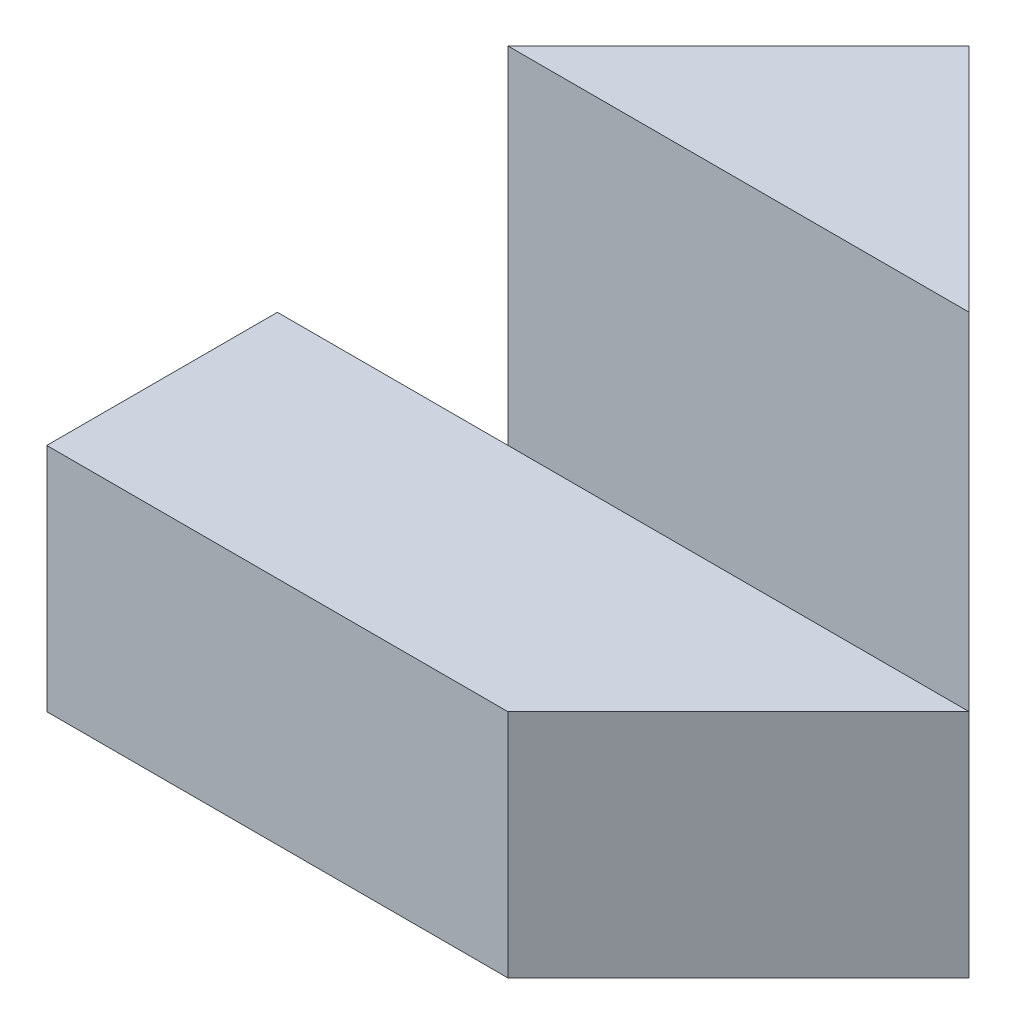
ISO-10303-21;
HEADER;
FILE_DESCRIPTION(('STEP AP214'),'2;1');
FILE_NAME('part.step','',(''),(''),'','','');
FILE_SCHEMA(('AUTOMOTIVE_DESIGN { 1 0 10303 214 1 1 1 1 }'));
ENDSEC;
DATA;
#1=APPLICATION_CONTEXT('core data for automotive mechanical design processes');
#2=APPLICATION_PROTOCOL_DEFINITION('international standard','automotive_design',2000,#1);
#3=PRODUCT_CONTEXT('',#1,'mechanical');
#4=PRODUCT('Part','Part','',(#3));
#5=PRODUCT_RELATED_PRODUCT_CATEGORY('part','',(#4));
#6=PRODUCT_DEFINITION_FORMATION('','',#4);
#7=PRODUCT_DEFINITION_CONTEXT('part definition',#1,'design');
#8=PRODUCT_DEFINITION('design','',#6,#7);
#9=PRODUCT_DEFINITION_SHAPE('','',#8);
#10=(LENGTH_UNIT() NAMED_UNIT(*) SI_UNIT(.MILLI.,.METRE.));
#11=(NAMED_UNIT(*) PLANE_ANGLE_UNIT() SI_UNIT($,.RADIAN.));
#12=(NAMED_UNIT(*) SI_UNIT($,.STERADIAN.) SOLID_ANGLE_UNIT());
#13=UNCERTAINTY_MEASURE_WITH_UNIT(LENGTH_MEASURE(1.E-05),#10,'distance_accuracy_value','');
#14=(GEOMETRIC_REPRESENTATION_CONTEXT(3) GLOBAL_UNCERTAINTY_ASSIGNED_CONTEXT((#13)) GLOBAL_UNIT_ASSIGNED_CONTEXT((#10,
#11,#12)) REPRESENTATION_CONTEXT('',''));
#15=CARTESIAN_POINT('',(0.,0.,0.));
#16=DIRECTION('',(0.,0.,1.));
#17=DIRECTION('',(1.,0.,0.));
#18=AXIS2_PLACEMENT_3D('',#15,#16,#17);
#19=CARTESIAN_POINT('',(0.,0.,2.));
#20=DIRECTION('',(0.,0.,-1.));
#21=DIRECTION('',(-1.,0.,0.));
#22=AXIS2_PLACEMENT_3D('',#19,#20,#21);
#23=PLANE('',#22);
#24=DIRECTION('',(-1.,0.,0.));
#25=VECTOR('',#24,1.);
#26=CARTESIAN_POINT('',(-2.,2.5,2.));
#27=LINE('',#26,#25);
#28=CARTESIAN_POINT('',(4.,2.5,2.));
#29=VERTEX_POINT('',#28);
#30=CARTESIAN_POINT('',(0.,2.5,2.));
#31=VERTEX_POINT('',#30);
#32=EDGE_CURVE('E43',#29,#31,#27,.T.);
#33=ORIENTED_EDGE('',*,*,#32,.T.);
#34=DIRECTION('',(0.,1.,0.));
#35=VECTOR('',#34,1.);
#36=CARTESIAN_POINT('',(0.,-2.5,2.));
#37=LINE('',#36,#35);
#38=CARTESIAN_POINT('',(0.,-0.5,2.));
#39=VERTEX_POINT('',#38);
#40=EDGE_CURVE('E112',#39,#31,#37,.T.);
#41=ORIENTED_EDGE('',*,*,#40,.F.);
#42=DIRECTION('',(-1.,0.,0.));
#43=VECTOR('',#42,1.);
#44=CARTESIAN_POINT('',(-2.,-0.5,2.));
#45=LINE('',#44,#43);
#46=CARTESIAN_POINT('',(4.,-0.5,2.));
#47=VERTEX_POINT('',#46);
#48=EDGE_CURVE('E123',#47,#39,#45,.T.);
#49=ORIENTED_EDGE('',*,*,#48,.F.);
#50=DIRECTION('',(0.,1.,0.));
#51=VECTOR('',#50,1.);
#52=CARTESIAN_POINT('',(4.,-2.5,2.));
#53=LINE('',#52,#51);
#54=EDGE_CURVE('E149',#47,#29,#53,.T.);
#55=ORIENTED_EDGE('',*,*,#54,.T.);
#56=EDGE_LOOP('',(#33,#41,#49,#55));
#57=FACE_BOUND('',#56,.T.);
#58=ADVANCED_FACE('F33',(#57),#23,.F.);
#59=CARTESIAN_POINT('',(-2.,2.5,2.));
#60=DIRECTION('',(0.,-1.,0.));
#61=DIRECTION('',(0.,0.,-1.));
#62=AXIS2_PLACEMENT_3D('',#59,#60,#61);
#63=PLANE('',#62);
#64=DIRECTION('',(-0.707106781186548,0.,-0.707106781186548));
#65=VECTOR('',#64,1.);
#66=CARTESIAN_POINT('',(2.,2.5,0.));
#67=LINE('',#66,#65);
#68=CARTESIAN_POINT('',(2.,2.5,0.));
#69=VERTEX_POINT('',#68);
#70=EDGE_CURVE('E152',#29,#69,#67,.T.);
#71=ORIENTED_EDGE('',*,*,#70,.T.);
#72=DIRECTION('',(0.707106781186547,0.,-0.707106781186548));
#73=VECTOR('',#72,1.);
#74=CARTESIAN_POINT('',(0.,2.5,2.));
#75=LINE('',#74,#73);
#76=EDGE_CURVE('E104',#31,#69,#75,.T.);
#77=ORIENTED_EDGE('',*,*,#76,.F.);
#78=ORIENTED_EDGE('',*,*,#32,.F.);
#79=EDGE_LOOP('',(#71,#77,#78));
#80=FACE_BOUND('',#79,.T.);
#81=ADVANCED_FACE('F35',(#80),#63,.F.);
#82=CARTESIAN_POINT('',(-2.,-2.5,2.));
#83=DIRECTION('',(1.,0.,0.));
#84=DIRECTION('',(0.,0.,-1.));
#85=AXIS2_PLACEMENT_3D('',#82,#83,#84);
#86=PLANE('',#85);
#87=DIRECTION('',(0.,0.,-1.));
#88=VECTOR('',#87,1.);
#89=CARTESIAN_POINT('',(-2.,-0.5,4.));
#90=LINE('',#89,#88);
#91=CARTESIAN_POINT('',(-2.,-0.5,4.));
#92=VERTEX_POINT('',#91);
#93=CARTESIAN_POINT('',(-2.,-0.5,2.));
#94=VERTEX_POINT('',#93);
#95=EDGE_CURVE('E111',#92,#94,#90,.T.);
#96=ORIENTED_EDGE('',*,*,#95,.T.);
#97=DIRECTION('',(0.,1.,0.));
#98=VECTOR('',#97,1.);
#99=CARTESIAN_POINT('',(-2.,-2.5,2.));
#100=LINE('',#99,#98);
#101=CARTESIAN_POINT('',(-2.,-2.5,2.));
#102=VERTEX_POINT('',#101);
#103=EDGE_CURVE('E96',#102,#94,#100,.T.);
#104=ORIENTED_EDGE('',*,*,#103,.F.);
#105=DIRECTION('',(0.,0.,-1.));
#106=VECTOR('',#105,1.);
#107=CARTESIAN_POINT('',(-2.,-2.5,2.));
#108=LINE('',#107,#106);
#109=CARTESIAN_POINT('',(-2.,-2.5,4.));
#110=VERTEX_POINT('',#109);
#111=EDGE_CURVE('E11',#110,#102,#108,.T.);
#112=ORIENTED_EDGE('',*,*,#111,.F.);
#113=DIRECTION('',(0.,-1.,0.));
#114=VECTOR('',#113,1.);
#115=CARTESIAN_POINT('',(-2.,-2.5,4.));
#116=LINE('',#115,#114);
#117=EDGE_CURVE('E120',#92,#110,#116,.T.);
#118=ORIENTED_EDGE('',*,*,#117,.F.);
#119=EDGE_LOOP('',(#96,#104,#112,#118));
#120=FACE_BOUND('',#119,.T.);
#121=ADVANCED_FACE('F108',(#120),#86,.F.);
#122=CARTESIAN_POINT('',(-2.,-2.5,2.));
#123=DIRECTION('',(0.,1.,0.));
#124=DIRECTION('',(0.,0.,1.));
#125=AXIS2_PLACEMENT_3D('',#122,#123,#124);
#126=PLANE('',#125);
#127=DIRECTION('',(1.,0.,0.));
#128=VECTOR('',#127,1.);
#129=CARTESIAN_POINT('',(-2.,-2.5,2.));
#130=LINE('',#129,#128);
#131=CARTESIAN_POINT('',(0.,-2.5,2.));
#132=VERTEX_POINT('',#131);
#133=EDGE_CURVE('E93',#102,#132,#130,.T.);
#134=ORIENTED_EDGE('',*,*,#133,.T.);
#135=DIRECTION('',(0.707106781186547,0.,-0.707106781186548));
#136=VECTOR('',#135,1.);
#137=CARTESIAN_POINT('',(0.,-2.5,2.));
#138=LINE('',#137,#136);
#139=CARTESIAN_POINT('',(2.,-2.5,0.));
#140=VERTEX_POINT('',#139);
#141=EDGE_CURVE('E103',#132,#140,#138,.T.);
#142=ORIENTED_EDGE('',*,*,#141,.T.);
#143=DIRECTION('',(-0.707106781186548,0.,-0.707106781186548));
#144=VECTOR('',#143,1.);
#145=CARTESIAN_POINT('',(2.,-2.5,0.));
#146=LINE('',#145,#144);
#147=CARTESIAN_POINT('',(4.,-2.5,2.));
#148=VERTEX_POINT('',#147);
#149=EDGE_CURVE('E160',#148,#140,#146,.T.);
#150=ORIENTED_EDGE('',*,*,#149,.F.);
#151=DIRECTION('',(0.707106781186547,0.,-0.707106781186548));
#152=VECTOR('',#151,1.);
#153=CARTESIAN_POINT('',(2.,-2.5,4.));
#154=LINE('',#153,#152);
#155=CARTESIAN_POINT('',(2.,-2.5,4.));
#156=VERTEX_POINT('',#155);
#157=EDGE_CURVE('E119',#156,#148,#154,.T.);
#158=ORIENTED_EDGE('',*,*,#157,.F.);
#159=DIRECTION('',(1.,0.,0.));
#160=VECTOR('',#159,1.);
#161=CARTESIAN_POINT('',(-2.,-2.5,4.));
#162=LINE('',#161,#160);
#163=EDGE_CURVE('E116',#110,#156,#162,.T.);
#164=ORIENTED_EDGE('',*,*,#163,.F.);
#165=ORIENTED_EDGE('',*,*,#111,.T.);
#166=EDGE_LOOP('',(#134,#142,#150,#158,#164,#165));
#167=FACE_BOUND('',#166,.T.);
#168=ADVANCED_FACE('F114',(#167),#126,.F.);
#169=CARTESIAN_POINT('',(-2.,-0.5,4.));
#170=DIRECTION('',(0.,-1.,0.));
#171=DIRECTION('',(0.,0.,-1.));
#172=AXIS2_PLACEMENT_3D('',#169,#170,#171);
#173=PLANE('',#172);
#174=ORIENTED_EDGE('',*,*,#48,.T.);
#175=EDGE_CURVE('E37',#39,#94,#45,.T.);
#176=ORIENTED_EDGE('',*,*,#175,.T.);
#177=ORIENTED_EDGE('',*,*,#95,.F.);
#178=DIRECTION('',(-1.,0.,0.));
#179=VECTOR('',#178,1.);
#180=CARTESIAN_POINT('',(-2.,-0.5,4.));
#181=LINE('',#180,#179);
#182=CARTESIAN_POINT('',(2.,-0.5,4.));
#183=VERTEX_POINT('',#182);
#184=EDGE_CURVE('E51',#183,#92,#181,.T.);
#185=ORIENTED_EDGE('',*,*,#184,.F.);
#186=DIRECTION('',(0.707106781186547,0.,-0.707106781186548));
#187=VECTOR('',#186,1.);
#188=CARTESIAN_POINT('',(2.,-0.5,4.));
#189=LINE('',#188,#187);
#190=EDGE_CURVE('E164',#183,#47,#189,.T.);
#191=ORIENTED_EDGE('',*,*,#190,.T.);
#192=EDGE_LOOP('',(#174,#176,#177,#185,#191));
#193=FACE_BOUND('',#192,.T.);
#194=ADVANCED_FACE('F168',(#193),#173,.F.);
#195=CARTESIAN_POINT('',(0.,0.,4.));
#196=DIRECTION('',(0.,0.,-1.));
#197=DIRECTION('',(-1.,0.,0.));
#198=AXIS2_PLACEMENT_3D('',#195,#196,#197);
#199=PLANE('',#198);
#200=ORIENTED_EDGE('',*,*,#117,.T.);
#201=ORIENTED_EDGE('',*,*,#163,.T.);
#202=DIRECTION('',(0.,1.,0.));
#203=VECTOR('',#202,1.);
#204=CARTESIAN_POINT('',(2.,-2.5,4.));
#205=LINE('',#204,#203);
#206=EDGE_CURVE('E56',#156,#183,#205,.T.);
#207=ORIENTED_EDGE('',*,*,#206,.T.);
#208=ORIENTED_EDGE('',*,*,#184,.T.);
#209=EDGE_LOOP('',(#200,#201,#207,#208));
#210=FACE_BOUND('',#209,.T.);
#211=ADVANCED_FACE('F122',(#210),#199,.F.);
#212=CARTESIAN_POINT('',(2.,-2.5,4.));
#213=DIRECTION('',(0.707106781186548,0.,0.707106781186547));
#214=DIRECTION('',(0.707106781186547,0.,-0.707106781186548));
#215=AXIS2_PLACEMENT_3D('',#212,#213,#214);
#216=PLANE('',#215);
#217=ORIENTED_EDGE('',*,*,#190,.F.);
#218=ORIENTED_EDGE('',*,*,#206,.F.);
#219=ORIENTED_EDGE('',*,*,#157,.T.);
#220=DIRECTION('',(0.,1.,0.));
#221=VECTOR('',#220,1.);
#222=CARTESIAN_POINT('',(4.,-2.5,2.));
#223=LINE('',#222,#221);
#224=EDGE_CURVE('E128',#148,#47,#223,.T.);
#225=ORIENTED_EDGE('',*,*,#224,.T.);
#226=EDGE_LOOP('',(#217,#218,#219,#225));
#227=FACE_BOUND('',#226,.T.);
#228=ADVANCED_FACE('F171',(#227),#216,.T.);
#229=CARTESIAN_POINT('',(2.,-2.5,0.));
#230=DIRECTION('',(0.707106781186548,0.,-0.707106781186548));
#231=DIRECTION('',(-0.707106781186548,0.,-0.707106781186548));
#232=AXIS2_PLACEMENT_3D('',#229,#230,#231);
#233=PLANE('',#232);
#234=ORIENTED_EDGE('',*,*,#70,.F.);
#235=ORIENTED_EDGE('',*,*,#54,.F.);
#236=ORIENTED_EDGE('',*,*,#224,.F.);
#237=ORIENTED_EDGE('',*,*,#149,.T.);
#238=DIRECTION('',(0.,1.,0.));
#239=VECTOR('',#238,1.);
#240=CARTESIAN_POINT('',(2.,-2.5,0.));
#241=LINE('',#240,#239);
#242=EDGE_CURVE('E137',#140,#69,#241,.T.);
#243=ORIENTED_EDGE('',*,*,#242,.T.);
#244=EDGE_LOOP('',(#234,#235,#236,#237,#243));
#245=FACE_BOUND('',#244,.T.);
#246=ADVANCED_FACE('F173',(#245),#233,.T.);
#247=CARTESIAN_POINT('',(-2.,-2.5,2.));
#248=DIRECTION('',(0.,0.,1.));
#249=DIRECTION('',(1.,0.,0.));
#250=AXIS2_PLACEMENT_3D('',#247,#248,#249);
#251=PLANE('',#250);
#252=EDGE_CURVE('E99',#132,#39,#37,.T.);
#253=ORIENTED_EDGE('',*,*,#252,.F.);
#254=ORIENTED_EDGE('',*,*,#133,.F.);
#255=ORIENTED_EDGE('',*,*,#103,.T.);
#256=ORIENTED_EDGE('',*,*,#175,.F.);
#257=EDGE_LOOP('',(#253,#254,#255,#256));
#258=FACE_BOUND('',#257,.T.);
#259=ADVANCED_FACE('F95',(#258),#251,.F.);
#260=CARTESIAN_POINT('',(0.,-2.5,2.));
#261=DIRECTION('',(0.707106781186548,0.,0.707106781186547));
#262=DIRECTION('',(0.707106781186547,0.,-0.707106781186548));
#263=AXIS2_PLACEMENT_3D('',#260,#261,#262);
#264=PLANE('',#263);
#265=ORIENTED_EDGE('',*,*,#76,.T.);
#266=ORIENTED_EDGE('',*,*,#242,.F.);
#267=ORIENTED_EDGE('',*,*,#141,.F.);
#268=ORIENTED_EDGE('',*,*,#252,.T.);
#269=ORIENTED_EDGE('',*,*,#40,.T.);
#270=EDGE_LOOP('',(#265,#266,#267,#268,#269));
#271=FACE_BOUND('',#270,.T.);
#272=ADVANCED_FACE('F172',(#271),#264,.F.);
#273=CLOSED_SHELL('',(#58,#81,#121,#168,#194,#211,#228,#246,#259,#272));
#274=MANIFOLD_SOLID_BREP('B2',#273);
#275=ADVANCED_BREP_SHAPE_REPRESENTATION('',(#18,#274),#14);
#276=SHAPE_DEFINITION_REPRESENTATION(#9,#275);
ENDSEC;
END-ISO-10303-21;
